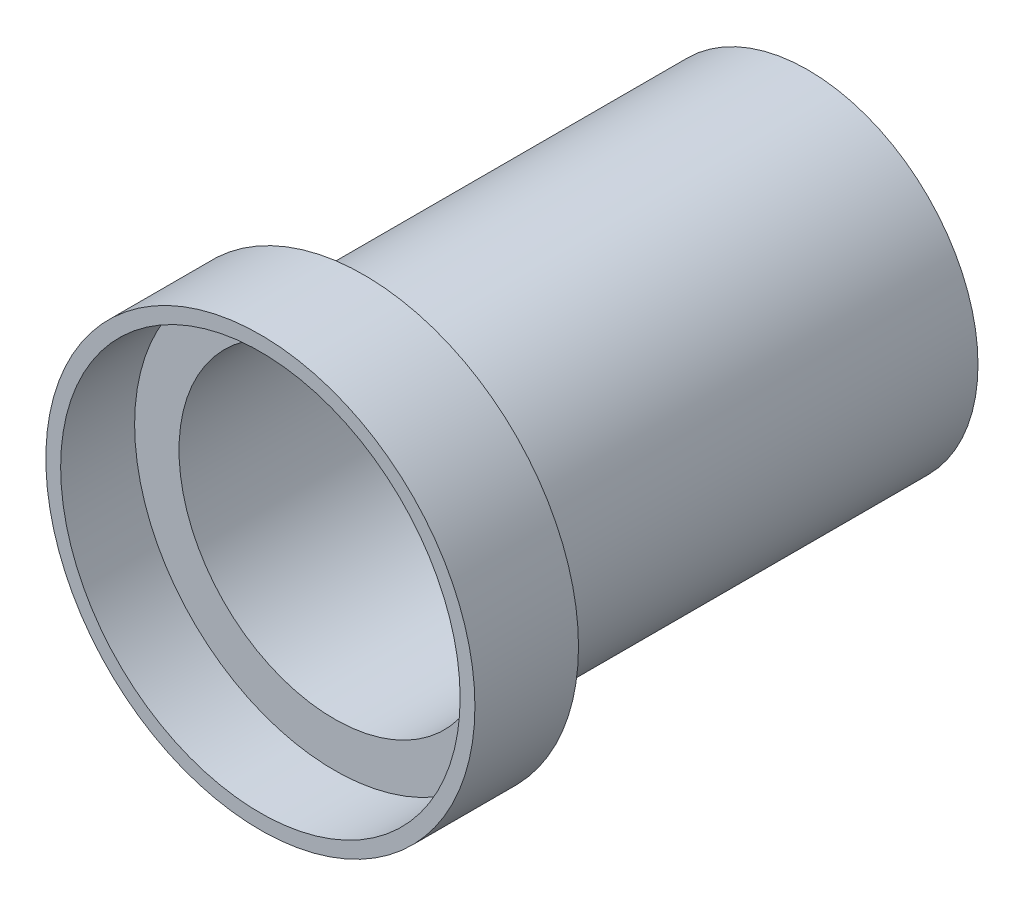
ISO-10303-21;
HEADER;
FILE_DESCRIPTION(('STEP AP214'),'2;1');
FILE_NAME('part.step','',(''),(''),'','','');
FILE_SCHEMA(('AUTOMOTIVE_DESIGN { 1 0 10303 214 1 1 1 1 }'));
ENDSEC;
DATA;
#1=APPLICATION_CONTEXT('core data for automotive mechanical design processes');
#2=APPLICATION_PROTOCOL_DEFINITION('international standard','automotive_design',2000,#1);
#3=PRODUCT_CONTEXT('',#1,'mechanical');
#4=PRODUCT('Part','Part','',(#3));
#5=PRODUCT_RELATED_PRODUCT_CATEGORY('part','',(#4));
#6=PRODUCT_DEFINITION_FORMATION('','',#4);
#7=PRODUCT_DEFINITION_CONTEXT('part definition',#1,'design');
#8=PRODUCT_DEFINITION('design','',#6,#7);
#9=PRODUCT_DEFINITION_SHAPE('','',#8);
#10=(LENGTH_UNIT() NAMED_UNIT(*) SI_UNIT(.MILLI.,.METRE.));
#11=(NAMED_UNIT(*) PLANE_ANGLE_UNIT() SI_UNIT($,.RADIAN.));
#12=(NAMED_UNIT(*) SI_UNIT($,.STERADIAN.) SOLID_ANGLE_UNIT());
#13=UNCERTAINTY_MEASURE_WITH_UNIT(LENGTH_MEASURE(1.E-05),#10,'distance_accuracy_value','');
#14=(GEOMETRIC_REPRESENTATION_CONTEXT(3) GLOBAL_UNCERTAINTY_ASSIGNED_CONTEXT((#13)) GLOBAL_UNIT_ASSIGNED_CONTEXT((#10,
#11,#12)) REPRESENTATION_CONTEXT('',''));
#15=CARTESIAN_POINT('',(0.,0.,0.));
#16=DIRECTION('',(0.,0.,1.));
#17=DIRECTION('',(1.,0.,0.));
#18=AXIS2_PLACEMENT_3D('',#15,#16,#17);
#19=CARTESIAN_POINT('',(0.,0.,32.));
#20=DIRECTION('',(0.,0.,1.));
#21=DIRECTION('',(1.,0.,0.));
#22=AXIS2_PLACEMENT_3D('',#19,#20,#21);
#23=PLANE('',#22);
#24=CARTESIAN_POINT('',(0.,0.,32.));
#25=DIRECTION('',(0.,0.,1.));
#26=DIRECTION('',(1.,0.,0.));
#27=AXIS2_PLACEMENT_3D('',#24,#25,#26);
#28=CIRCLE('',#27,13.5);
#29=CARTESIAN_POINT('',(13.5,0.,32.));
#30=VERTEX_POINT('',#29);
#31=EDGE_CURVE('E47',#30,#30,#28,.T.);
#32=ORIENTED_EDGE('',*,*,#31,.T.);
#33=EDGE_LOOP('',(#32));
#34=FACE_BOUND('',#33,.T.);
#35=CARTESIAN_POINT('',(0.,0.,32.));
#36=DIRECTION('',(0.,0.,1.));
#37=DIRECTION('',(1.,0.,0.));
#38=AXIS2_PLACEMENT_3D('',#35,#36,#37);
#39=CIRCLE('',#38,10.5);
#40=CARTESIAN_POINT('',(10.5,0.,32.));
#41=VERTEX_POINT('',#40);
#42=EDGE_CURVE('E33',#41,#41,#39,.F.);
#43=ORIENTED_EDGE('',*,*,#42,.T.);
#44=EDGE_LOOP('',(#43));
#45=FACE_BOUND('',#44,.T.);
#46=ADVANCED_FACE('F29',(#34,#45),#23,.T.);
#47=CARTESIAN_POINT('',(0.,0.,30.));
#48=DIRECTION('',(0.,0.,-1.));
#49=DIRECTION('',(-1.,0.,0.));
#50=AXIS2_PLACEMENT_3D('',#47,#48,#49);
#51=CYLINDRICAL_SURFACE('',#50,11.5);
#52=CARTESIAN_POINT('',(0.,0.,30.));
#53=DIRECTION('',(0.,0.,1.));
#54=DIRECTION('',(1.,0.,0.));
#55=AXIS2_PLACEMENT_3D('',#52,#53,#54);
#56=CIRCLE('',#55,11.5);
#57=CARTESIAN_POINT('',(11.5,0.,30.));
#58=VERTEX_POINT('',#57);
#59=EDGE_CURVE('E10',#58,#58,#56,.T.);
#60=ORIENTED_EDGE('',*,*,#59,.F.);
#61=EDGE_LOOP('',(#60));
#62=FACE_BOUND('',#61,.T.);
#63=CARTESIAN_POINT('',(0.,0.,0.));
#64=DIRECTION('',(0.,0.,1.));
#65=DIRECTION('',(1.,0.,0.));
#66=AXIS2_PLACEMENT_3D('',#63,#64,#65);
#67=CIRCLE('',#66,11.5);
#68=CARTESIAN_POINT('',(11.5,0.,0.));
#69=VERTEX_POINT('',#68);
#70=EDGE_CURVE('E37',#69,#69,#67,.T.);
#71=ORIENTED_EDGE('',*,*,#70,.T.);
#72=EDGE_LOOP('',(#71));
#73=FACE_BOUND('',#72,.T.);
#74=ADVANCED_FACE('F31',(#62,#73),#51,.T.);
#75=CARTESIAN_POINT('',(0.,0.,0.));
#76=DIRECTION('',(0.,0.,1.));
#77=DIRECTION('',(1.,0.,0.));
#78=AXIS2_PLACEMENT_3D('',#75,#76,#77);
#79=PLANE('',#78);
#80=ORIENTED_EDGE('',*,*,#70,.F.);
#81=EDGE_LOOP('',(#80));
#82=FACE_BOUND('',#81,.T.);
#83=ADVANCED_FACE('F83',(#82),#79,.F.);
#84=CARTESIAN_POINT('',(0.,0.,30.));
#85=DIRECTION('',(0.,0.,1.));
#86=DIRECTION('',(1.,0.,0.));
#87=AXIS2_PLACEMENT_3D('',#84,#85,#86);
#88=PLANE('',#87);
#89=CARTESIAN_POINT('',(0.,0.,30.));
#90=DIRECTION('',(0.,0.,1.));
#91=DIRECTION('',(1.,0.,0.));
#92=AXIS2_PLACEMENT_3D('',#89,#90,#91);
#93=CIRCLE('',#92,14.5);
#94=CARTESIAN_POINT('',(14.5,0.,30.));
#95=VERTEX_POINT('',#94);
#96=EDGE_CURVE('E44',#95,#95,#93,.T.);
#97=ORIENTED_EDGE('',*,*,#96,.F.);
#98=EDGE_LOOP('',(#97));
#99=FACE_BOUND('',#98,.T.);
#100=ORIENTED_EDGE('',*,*,#59,.T.);
#101=EDGE_LOOP('',(#100));
#102=FACE_BOUND('',#101,.T.);
#103=ADVANCED_FACE('F90',(#99,#102),#88,.F.);
#104=CARTESIAN_POINT('',(0.,0.,37.));
#105=DIRECTION('',(0.,0.,-1.));
#106=DIRECTION('',(-1.,0.,0.));
#107=AXIS2_PLACEMENT_3D('',#104,#105,#106);
#108=CYLINDRICAL_SURFACE('',#107,14.5);
#109=CARTESIAN_POINT('',(0.,0.,37.));
#110=DIRECTION('',(0.,0.,1.));
#111=DIRECTION('',(1.,0.,0.));
#112=AXIS2_PLACEMENT_3D('',#109,#110,#111);
#113=CIRCLE('',#112,14.5);
#114=CARTESIAN_POINT('',(14.5,0.,37.));
#115=VERTEX_POINT('',#114);
#116=EDGE_CURVE('E42',#115,#115,#113,.T.);
#117=ORIENTED_EDGE('',*,*,#116,.F.);
#118=EDGE_LOOP('',(#117));
#119=FACE_BOUND('',#118,.T.);
#120=ORIENTED_EDGE('',*,*,#96,.T.);
#121=EDGE_LOOP('',(#120));
#122=FACE_BOUND('',#121,.T.);
#123=ADVANCED_FACE('F88',(#119,#122),#108,.T.);
#124=CARTESIAN_POINT('',(0.,0.,37.));
#125=DIRECTION('',(0.,0.,1.));
#126=DIRECTION('',(1.,0.,0.));
#127=AXIS2_PLACEMENT_3D('',#124,#125,#126);
#128=PLANE('',#127);
#129=CARTESIAN_POINT('',(0.,0.,37.));
#130=DIRECTION('',(0.,0.,1.));
#131=DIRECTION('',(1.,0.,0.));
#132=AXIS2_PLACEMENT_3D('',#129,#130,#131);
#133=CIRCLE('',#132,13.5);
#134=CARTESIAN_POINT('',(13.5,0.,37.));
#135=VERTEX_POINT('',#134);
#136=EDGE_CURVE('E50',#135,#135,#133,.T.);
#137=ORIENTED_EDGE('',*,*,#136,.F.);
#138=EDGE_LOOP('',(#137));
#139=FACE_BOUND('',#138,.T.);
#140=ORIENTED_EDGE('',*,*,#116,.T.);
#141=EDGE_LOOP('',(#140));
#142=FACE_BOUND('',#141,.T.);
#143=ADVANCED_FACE('F74',(#139,#142),#128,.T.);
#144=CARTESIAN_POINT('',(0.,0.,32.));
#145=DIRECTION('',(0.,0.,1.));
#146=DIRECTION('',(1.,0.,0.));
#147=AXIS2_PLACEMENT_3D('',#144,#145,#146);
#148=CYLINDRICAL_SURFACE('',#147,13.5);
#149=ORIENTED_EDGE('',*,*,#31,.F.);
#150=EDGE_LOOP('',(#149));
#151=FACE_BOUND('',#150,.T.);
#152=ORIENTED_EDGE('',*,*,#136,.T.);
#153=EDGE_LOOP('',(#152));
#154=FACE_BOUND('',#153,.T.);
#155=ADVANCED_FACE('F67',(#151,#154),#148,.F.);
#156=CARTESIAN_POINT('',(0.,0.,37.));
#157=DIRECTION('',(0.,0.,-1.));
#158=DIRECTION('',(-1.,0.,0.));
#159=AXIS2_PLACEMENT_3D('',#156,#157,#158);
#160=CYLINDRICAL_SURFACE('',#159,10.5);
#161=ORIENTED_EDGE('',*,*,#42,.F.);
#162=EDGE_LOOP('',(#161));
#163=FACE_BOUND('',#162,.T.);
#164=CARTESIAN_POINT('',(0.,0.,1.));
#165=DIRECTION('',(0.,0.,1.));
#166=DIRECTION('',(1.,0.,0.));
#167=AXIS2_PLACEMENT_3D('',#164,#165,#166);
#168=CIRCLE('',#167,10.5);
#169=CARTESIAN_POINT('',(10.5,0.,1.));
#170=VERTEX_POINT('',#169);
#171=EDGE_CURVE('E55',#170,#170,#168,.T.);
#172=ORIENTED_EDGE('',*,*,#171,.F.);
#173=EDGE_LOOP('',(#172));
#174=FACE_BOUND('',#173,.T.);
#175=ADVANCED_FACE('F63',(#163,#174),#160,.F.);
#176=CARTESIAN_POINT('',(0.,0.,1.));
#177=DIRECTION('',(0.,0.,1.));
#178=DIRECTION('',(1.,0.,0.));
#179=AXIS2_PLACEMENT_3D('',#176,#177,#178);
#180=PLANE('',#179);
#181=ORIENTED_EDGE('',*,*,#171,.T.);
#182=EDGE_LOOP('',(#181));
#183=FACE_BOUND('',#182,.T.);
#184=ADVANCED_FACE('F66',(#183),#180,.T.);
#185=CLOSED_SHELL('',(#46,#74,#83,#103,#123,#143,#155,#175,#184));
#186=MANIFOLD_SOLID_BREP('B2',#185);
#187=ADVANCED_BREP_SHAPE_REPRESENTATION('',(#18,#186),#14);
#188=SHAPE_DEFINITION_REPRESENTATION(#9,#187);
ENDSEC;
END-ISO-10303-21;
